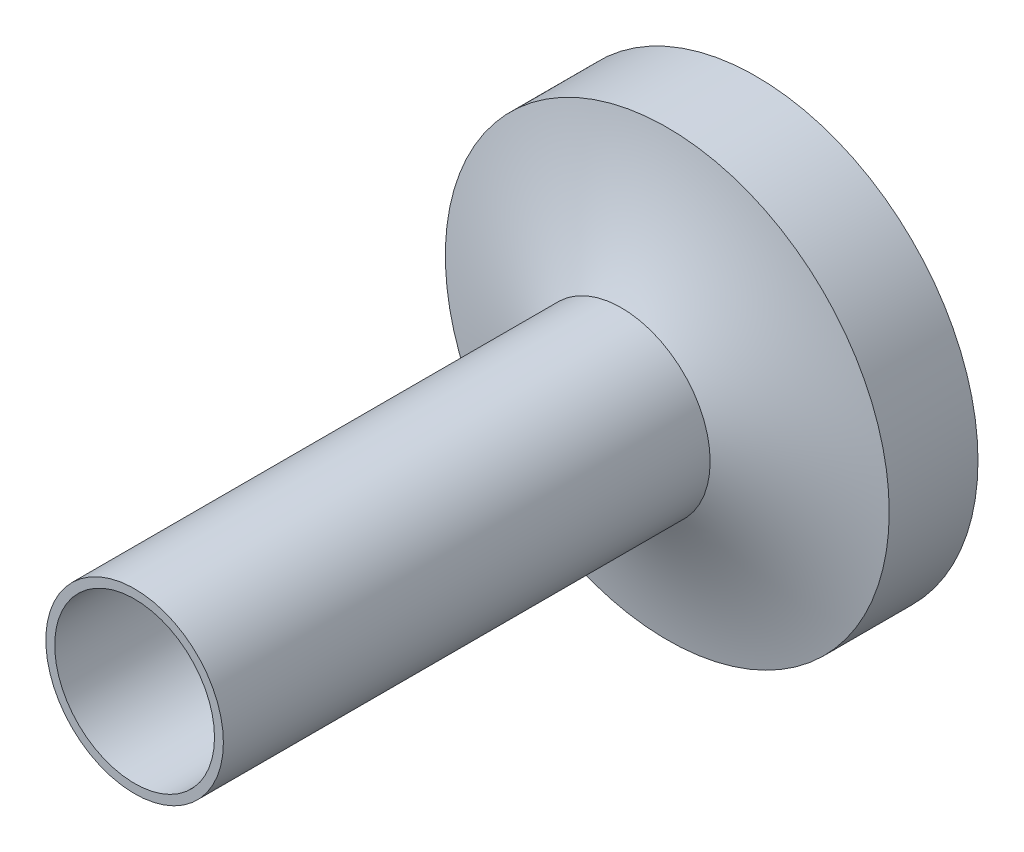
ISO-10303-21;
HEADER;
FILE_DESCRIPTION(('STEP AP214'),'2;1');
FILE_NAME('part.step','',(''),(''),'','','');
FILE_SCHEMA(('AUTOMOTIVE_DESIGN { 1 0 10303 214 1 1 1 1 }'));
ENDSEC;
DATA;
#1=APPLICATION_CONTEXT('core data for automotive mechanical design processes');
#2=APPLICATION_PROTOCOL_DEFINITION('international standard','automotive_design',2000,#1);
#3=PRODUCT_CONTEXT('',#1,'mechanical');
#4=PRODUCT('Part','Part','',(#3));
#5=PRODUCT_RELATED_PRODUCT_CATEGORY('part','',(#4));
#6=PRODUCT_DEFINITION_FORMATION('','',#4);
#7=PRODUCT_DEFINITION_CONTEXT('part definition',#1,'design');
#8=PRODUCT_DEFINITION('design','',#6,#7);
#9=PRODUCT_DEFINITION_SHAPE('','',#8);
#10=(LENGTH_UNIT() NAMED_UNIT(*) SI_UNIT(.MILLI.,.METRE.));
#11=(NAMED_UNIT(*) PLANE_ANGLE_UNIT() SI_UNIT($,.RADIAN.));
#12=(NAMED_UNIT(*) SI_UNIT($,.STERADIAN.) SOLID_ANGLE_UNIT());
#13=UNCERTAINTY_MEASURE_WITH_UNIT(LENGTH_MEASURE(1.E-05),#10,'distance_accuracy_value','');
#14=(GEOMETRIC_REPRESENTATION_CONTEXT(3) GLOBAL_UNCERTAINTY_ASSIGNED_CONTEXT((#13)) GLOBAL_UNIT_ASSIGNED_CONTEXT((#10,
#11,#12)) REPRESENTATION_CONTEXT('',''));
#15=CARTESIAN_POINT('',(0.,0.,0.));
#16=DIRECTION('',(0.,0.,1.));
#17=DIRECTION('',(1.,0.,0.));
#18=AXIS2_PLACEMENT_3D('',#15,#16,#17);
#19=CARTESIAN_POINT('',(0.,0.,1.));
#20=DIRECTION('',(0.,0.,-1.));
#21=DIRECTION('',(-1.,0.,0.));
#22=AXIS2_PLACEMENT_3D('',#19,#20,#21);
#23=CYLINDRICAL_SURFACE('',#22,1.);
#24=CARTESIAN_POINT('',(0.,0.,0.));
#25=DIRECTION('',(0.,0.,1.));
#26=DIRECTION('',(1.,0.,0.));
#27=AXIS2_PLACEMENT_3D('',#24,#25,#26);
#28=CIRCLE('',#27,1.);
#29=CARTESIAN_POINT('',(1.,0.,0.));
#30=VERTEX_POINT('',#29);
#31=EDGE_CURVE('E46',#30,#30,#28,.T.);
#32=ORIENTED_EDGE('',*,*,#31,.F.);
#33=EDGE_LOOP('',(#32));
#34=FACE_BOUND('',#33,.T.);
#35=CARTESIAN_POINT('',(0.,0.,1.));
#36=DIRECTION('',(0.,0.,1.));
#37=DIRECTION('',(1.,0.,0.));
#38=AXIS2_PLACEMENT_3D('',#35,#36,#37);
#39=CIRCLE('',#38,1.);
#40=CARTESIAN_POINT('',(1.,0.,1.));
#41=VERTEX_POINT('',#40);
#42=EDGE_CURVE('E58',#41,#41,#39,.T.);
#43=ORIENTED_EDGE('',*,*,#42,.T.);
#44=EDGE_LOOP('',(#43));
#45=FACE_BOUND('',#44,.T.);
#46=ADVANCED_FACE('F35',(#34,#45),#23,.F.);
#47=CARTESIAN_POINT('',(0.,0.,0.));
#48=DIRECTION('',(0.,0.,1.));
#49=DIRECTION('',(1.,0.,0.));
#50=AXIS2_PLACEMENT_3D('',#47,#48,#49);
#51=PLANE('',#50);
#52=CARTESIAN_POINT('',(0.,0.,0.));
#53=DIRECTION('',(0.,0.,1.));
#54=DIRECTION('',(1.,0.,0.));
#55=AXIS2_PLACEMENT_3D('',#52,#53,#54);
#56=CIRCLE('',#55,2.5);
#57=CARTESIAN_POINT('',(2.5,0.,0.));
#58=VERTEX_POINT('',#57);
#59=EDGE_CURVE('E39',#58,#58,#56,.T.);
#60=ORIENTED_EDGE('',*,*,#59,.F.);
#61=EDGE_LOOP('',(#60));
#62=FACE_BOUND('',#61,.T.);
#63=ORIENTED_EDGE('',*,*,#31,.T.);
#64=EDGE_LOOP('',(#63));
#65=FACE_BOUND('',#64,.T.);
#66=ADVANCED_FACE('F72',(#62,#65),#51,.F.);
#67=CARTESIAN_POINT('',(0.,0.,1.));
#68=DIRECTION('',(0.,0.,-1.));
#69=DIRECTION('',(-1.,0.,0.));
#70=AXIS2_PLACEMENT_3D('',#67,#68,#69);
#71=CYLINDRICAL_SURFACE('',#70,2.5);
#72=CARTESIAN_POINT('',(0.,0.,1.));
#73=DIRECTION('',(0.,0.,1.));
#74=DIRECTION('',(1.,0.,0.));
#75=AXIS2_PLACEMENT_3D('',#72,#73,#74);
#76=CIRCLE('',#75,2.5);
#77=CARTESIAN_POINT('',(2.5,0.,1.));
#78=VERTEX_POINT('',#77);
#79=EDGE_CURVE('E10',#78,#78,#76,.T.);
#80=ORIENTED_EDGE('',*,*,#79,.F.);
#81=EDGE_LOOP('',(#80));
#82=FACE_BOUND('',#81,.T.);
#83=ORIENTED_EDGE('',*,*,#59,.T.);
#84=EDGE_LOOP('',(#83));
#85=FACE_BOUND('',#84,.T.);
#86=ADVANCED_FACE('F37',(#82,#85),#71,.T.);
#87=CARTESIAN_POINT('',(0.,2.5,1.));
#88=CARTESIAN_POINT('',(0.,1.72965977264994,1.13281984495295));
#89=CARTESIAN_POINT('',(0.,1.,1.51700099904417));
#90=B_SPLINE_CURVE_WITH_KNOTS('',2,(#87,#88,#89),.UNSPECIFIED.,.F.,.F.,(3,3),(0.,1.),.UNSPECIFIED.);
#91=CARTESIAN_POINT('',(0.,0.,7.04084682706707));
#92=DIRECTION('',(0.,0.,1.));
#93=AXIS1_PLACEMENT('',#91,#92);
#94=SURFACE_OF_REVOLUTION('',#90,#93);
#95=CARTESIAN_POINT('',(0.,0.,1.51700099904417));
#96=DIRECTION('',(0.,0.,1.));
#97=DIRECTION('',(1.,0.,0.));
#98=AXIS2_PLACEMENT_3D('',#95,#96,#97);
#99=CIRCLE('',#98,1.);
#100=CARTESIAN_POINT('',(1.,0.,1.51700099904417));
#101=VERTEX_POINT('',#100);
#102=EDGE_CURVE('E50',#101,#101,#99,.T.);
#103=ORIENTED_EDGE('',*,*,#102,.F.);
#104=EDGE_LOOP('',(#103));
#105=FACE_BOUND('',#104,.T.);
#106=ORIENTED_EDGE('',*,*,#79,.T.);
#107=EDGE_LOOP('',(#106));
#108=FACE_BOUND('',#107,.T.);
#109=ADVANCED_FACE('F64',(#105,#108),#94,.T.);
#110=CARTESIAN_POINT('',(0.,0.,7.));
#111=DIRECTION('',(0.,0.,-1.));
#112=DIRECTION('',(-1.,0.,0.));
#113=AXIS2_PLACEMENT_3D('',#110,#111,#112);
#114=CYLINDRICAL_SURFACE('',#113,1.);
#115=CARTESIAN_POINT('',(0.,0.,7.));
#116=DIRECTION('',(0.,0.,1.));
#117=DIRECTION('',(1.,0.,0.));
#118=AXIS2_PLACEMENT_3D('',#115,#116,#117);
#119=CIRCLE('',#118,1.);
#120=CARTESIAN_POINT('',(1.,0.,7.));
#121=VERTEX_POINT('',#120);
#122=EDGE_CURVE('E53',#121,#121,#119,.T.);
#123=ORIENTED_EDGE('',*,*,#122,.F.);
#124=EDGE_LOOP('',(#123));
#125=FACE_BOUND('',#124,.T.);
#126=ORIENTED_EDGE('',*,*,#102,.T.);
#127=EDGE_LOOP('',(#126));
#128=FACE_BOUND('',#127,.T.);
#129=ADVANCED_FACE('F68',(#125,#128),#114,.T.);
#130=CARTESIAN_POINT('',(0.,0.,7.));
#131=DIRECTION('',(0.,0.,1.));
#132=DIRECTION('',(1.,0.,0.));
#133=AXIS2_PLACEMENT_3D('',#130,#131,#132);
#134=PLANE('',#133);
#135=CARTESIAN_POINT('',(0.,0.,7.));
#136=DIRECTION('',(0.,0.,1.));
#137=DIRECTION('',(1.,0.,0.));
#138=AXIS2_PLACEMENT_3D('',#135,#136,#137);
#139=CIRCLE('',#138,0.9);
#140=CARTESIAN_POINT('',(0.9,0.,7.));
#141=VERTEX_POINT('',#140);
#142=EDGE_CURVE('E87',#141,#141,#139,.T.);
#143=ORIENTED_EDGE('',*,*,#142,.F.);
#144=EDGE_LOOP('',(#143));
#145=FACE_BOUND('',#144,.T.);
#146=ORIENTED_EDGE('',*,*,#122,.T.);
#147=EDGE_LOOP('',(#146));
#148=FACE_BOUND('',#147,.T.);
#149=ADVANCED_FACE('F106',(#145,#148),#134,.T.);
#150=CARTESIAN_POINT('',(0.,0.,1.));
#151=DIRECTION('',(0.,0.,1.));
#152=DIRECTION('',(1.,0.,0.));
#153=AXIS2_PLACEMENT_3D('',#150,#151,#152);
#154=PLANE('',#153);
#155=CARTESIAN_POINT('',(0.,0.,1.));
#156=DIRECTION('',(0.,0.,1.));
#157=DIRECTION('',(1.,0.,0.));
#158=AXIS2_PLACEMENT_3D('',#155,#156,#157);
#159=CIRCLE('',#158,0.9);
#160=CARTESIAN_POINT('',(0.9,0.,1.));
#161=VERTEX_POINT('',#160);
#162=EDGE_CURVE('E90',#161,#161,#159,.T.);
#163=ORIENTED_EDGE('',*,*,#162,.T.);
#164=EDGE_LOOP('',(#163));
#165=FACE_BOUND('',#164,.T.);
#166=ORIENTED_EDGE('',*,*,#42,.F.);
#167=EDGE_LOOP('',(#166));
#168=FACE_BOUND('',#167,.T.);
#169=ADVANCED_FACE('F98',(#165,#168),#154,.F.);
#170=CARTESIAN_POINT('',(0.,0.,7.));
#171=DIRECTION('',(0.,0.,-1.));
#172=DIRECTION('',(-1.,0.,0.));
#173=AXIS2_PLACEMENT_3D('',#170,#171,#172);
#174=CYLINDRICAL_SURFACE('',#173,0.9);
#175=ORIENTED_EDGE('',*,*,#142,.T.);
#176=EDGE_LOOP('',(#175));
#177=FACE_BOUND('',#176,.T.);
#178=ORIENTED_EDGE('',*,*,#162,.F.);
#179=EDGE_LOOP('',(#178));
#180=FACE_BOUND('',#179,.T.);
#181=ADVANCED_FACE('F100',(#177,#180),#174,.F.);
#182=CLOSED_SHELL('',(#46,#66,#86,#109,#129,#149,#169,#181));
#183=MANIFOLD_SOLID_BREP('B2',#182);
#184=ADVANCED_BREP_SHAPE_REPRESENTATION('',(#18,#183),#14);
#185=SHAPE_DEFINITION_REPRESENTATION(#9,#184);
ENDSEC;
END-ISO-10303-21;
